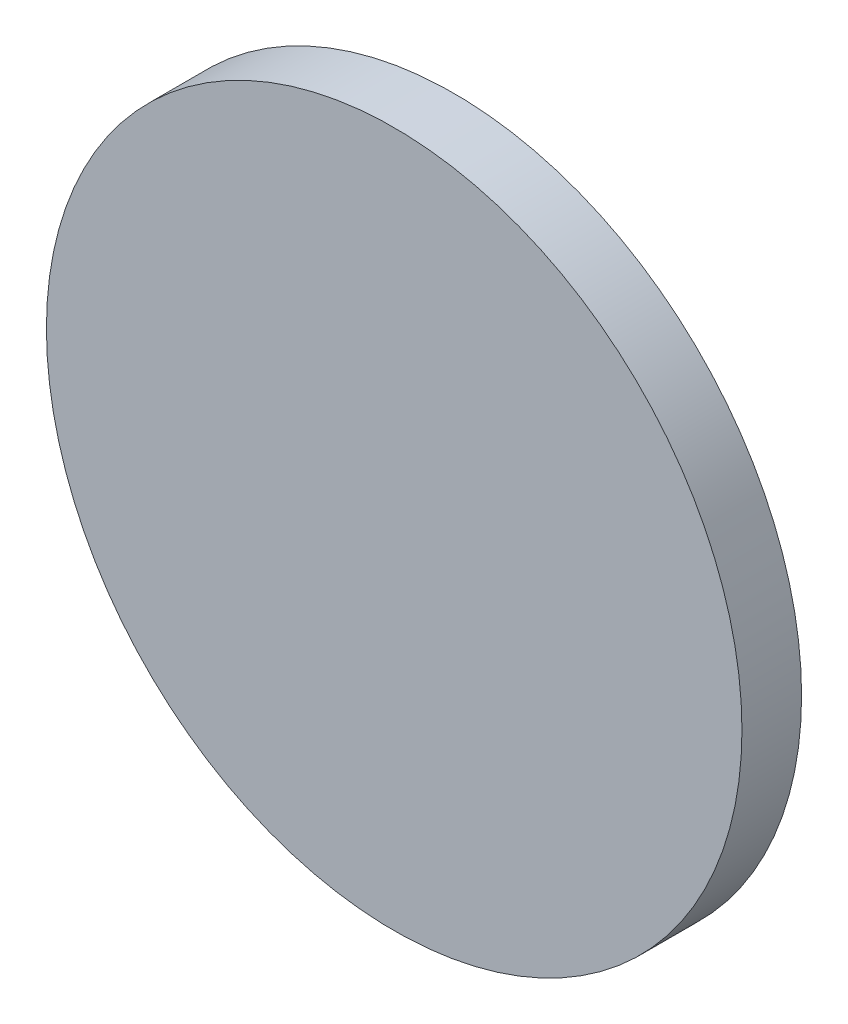
ISO-10303-21;
HEADER;
FILE_DESCRIPTION(('STEP AP214'),'2;1');
FILE_NAME('part.step','',(''),(''),'','','');
FILE_SCHEMA(('AUTOMOTIVE_DESIGN { 1 0 10303 214 1 1 1 1 }'));
ENDSEC;
DATA;
#1=APPLICATION_CONTEXT('core data for automotive mechanical design processes');
#2=APPLICATION_PROTOCOL_DEFINITION('international standard','automotive_design',2000,#1);
#3=PRODUCT_CONTEXT('',#1,'mechanical');
#4=PRODUCT('Part','Part','',(#3));
#5=PRODUCT_RELATED_PRODUCT_CATEGORY('part','',(#4));
#6=PRODUCT_DEFINITION_FORMATION('','',#4);
#7=PRODUCT_DEFINITION_CONTEXT('part definition',#1,'design');
#8=PRODUCT_DEFINITION('design','',#6,#7);
#9=PRODUCT_DEFINITION_SHAPE('','',#8);
#10=(LENGTH_UNIT() NAMED_UNIT(*) SI_UNIT(.MILLI.,.METRE.));
#11=(NAMED_UNIT(*) PLANE_ANGLE_UNIT() SI_UNIT($,.RADIAN.));
#12=(NAMED_UNIT(*) SI_UNIT($,.STERADIAN.) SOLID_ANGLE_UNIT());
#13=UNCERTAINTY_MEASURE_WITH_UNIT(LENGTH_MEASURE(1.E-05),#10,'distance_accuracy_value','');
#14=(GEOMETRIC_REPRESENTATION_CONTEXT(3) GLOBAL_UNCERTAINTY_ASSIGNED_CONTEXT((#13)) GLOBAL_UNIT_ASSIGNED_CONTEXT((#10,
#11,#12)) REPRESENTATION_CONTEXT('',''));
#15=CARTESIAN_POINT('',(0.,0.,0.));
#16=DIRECTION('',(0.,0.,1.));
#17=DIRECTION('',(1.,0.,0.));
#18=AXIS2_PLACEMENT_3D('',#15,#16,#17);
#19=CARTESIAN_POINT('',(11.59764,1.638300014875,0.));
#20=DIRECTION('',(0.,0.,-1.));
#21=DIRECTION('',(-1.,0.,0.));
#22=AXIS2_PLACEMENT_3D('',#19,#20,#21);
#23=PLANE('',#22);
#24=CARTESIAN_POINT('',(11.59764,1.638300014875,0.));
#25=DIRECTION('',(0.,0.,1.));
#26=DIRECTION('',(1.,0.,0.));
#27=AXIS2_PLACEMENT_3D('',#24,#25,#26);
#28=CIRCLE('',#27,0.200024667);
#29=CARTESIAN_POINT('',(11.797664667,1.638300014875,0.));
#30=VERTEX_POINT('',#29);
#31=EDGE_CURVE('E18',#30,#30,#28,.T.);
#32=ORIENTED_EDGE('',*,*,#31,.F.);
#33=EDGE_LOOP('',(#32));
#34=FACE_BOUND('',#33,.T.);
#35=ADVANCED_FACE('F15',(#34),#23,.T.);
#36=CARTESIAN_POINT('',(11.59764,1.638300014875,0.));
#37=DIRECTION('',(0.,0.,1.));
#38=DIRECTION('',(1.,0.,0.));
#39=AXIS2_PLACEMENT_3D('',#36,#37,#38);
#40=CYLINDRICAL_SURFACE('',#39,0.200024667);
#41=CARTESIAN_POINT('',(11.59764,1.638300014875,0.03429));
#42=DIRECTION('',(0.,0.,1.));
#43=DIRECTION('',(1.,0.,0.));
#44=AXIS2_PLACEMENT_3D('',#41,#42,#43);
#45=CIRCLE('',#44,0.200024667);
#46=CARTESIAN_POINT('',(11.797664667,1.638300014875,0.03429));
#47=VERTEX_POINT('',#46);
#48=EDGE_CURVE('E10',#47,#47,#45,.T.);
#49=ORIENTED_EDGE('',*,*,#48,.F.);
#50=EDGE_LOOP('',(#49));
#51=FACE_BOUND('',#50,.T.);
#52=ORIENTED_EDGE('',*,*,#31,.T.);
#53=EDGE_LOOP('',(#52));
#54=FACE_BOUND('',#53,.T.);
#55=ADVANCED_FACE('F27',(#51,#54),#40,.T.);
#56=CARTESIAN_POINT('',(11.59764,1.638300014875,0.03429));
#57=DIRECTION('',(0.,0.,1.));
#58=DIRECTION('',(1.,0.,0.));
#59=AXIS2_PLACEMENT_3D('',#56,#57,#58);
#60=PLANE('',#59);
#61=ORIENTED_EDGE('',*,*,#48,.T.);
#62=EDGE_LOOP('',(#61));
#63=FACE_BOUND('',#62,.T.);
#64=ADVANCED_FACE('F34',(#63),#60,.T.);
#65=CLOSED_SHELL('',(#35,#55,#64));
#66=MANIFOLD_SOLID_BREP('B1',#65);
#67=ADVANCED_BREP_SHAPE_REPRESENTATION('',(#18,#66),#14);
#68=SHAPE_DEFINITION_REPRESENTATION(#9,#67);
ENDSEC;
END-ISO-10303-21;
